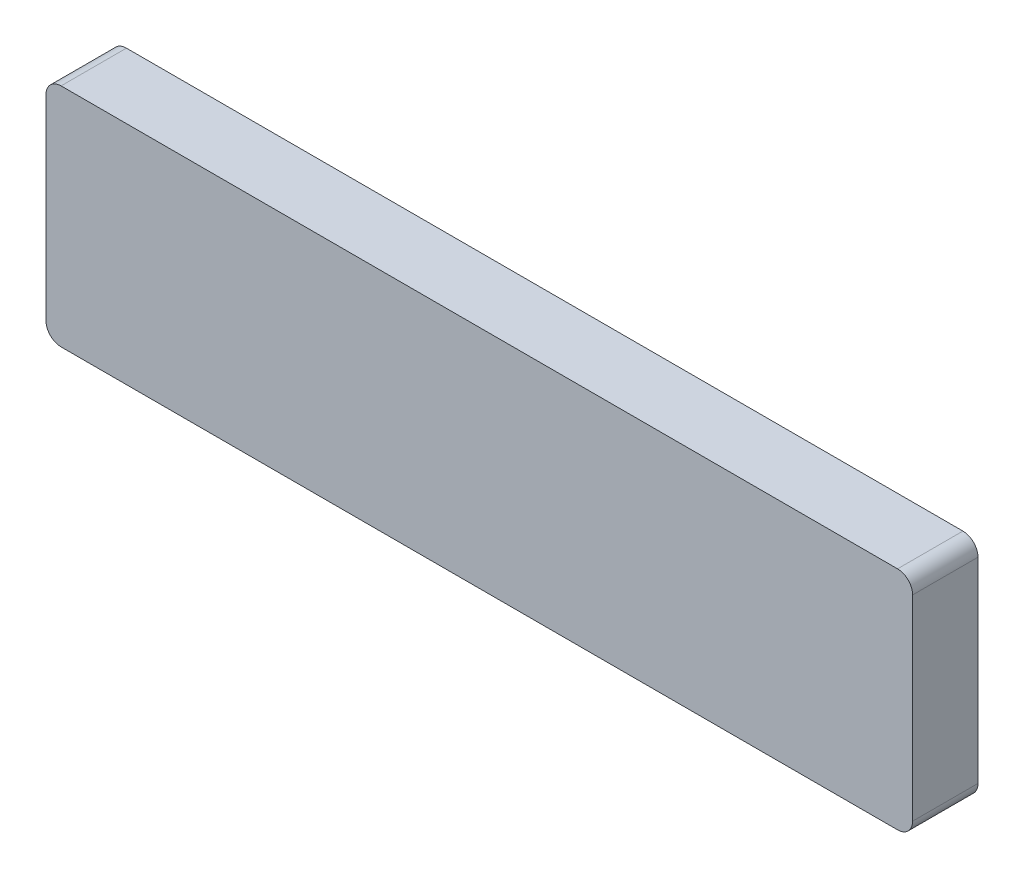
ISO-10303-21;
HEADER;
FILE_DESCRIPTION(('STEP AP214'),'2;1');
FILE_NAME('part.step','',(''),(''),'','','');
FILE_SCHEMA(('AUTOMOTIVE_DESIGN { 1 0 10303 214 1 1 1 1 }'));
ENDSEC;
DATA;
#1=APPLICATION_CONTEXT('core data for automotive mechanical design processes');
#2=APPLICATION_PROTOCOL_DEFINITION('international standard','automotive_design',2000,#1);
#3=PRODUCT_CONTEXT('',#1,'mechanical');
#4=PRODUCT('Part','Part','',(#3));
#5=PRODUCT_RELATED_PRODUCT_CATEGORY('part','',(#4));
#6=PRODUCT_DEFINITION_FORMATION('','',#4);
#7=PRODUCT_DEFINITION_CONTEXT('part definition',#1,'design');
#8=PRODUCT_DEFINITION('design','',#6,#7);
#9=PRODUCT_DEFINITION_SHAPE('','',#8);
#10=(LENGTH_UNIT() NAMED_UNIT(*) SI_UNIT(.MILLI.,.METRE.));
#11=(NAMED_UNIT(*) PLANE_ANGLE_UNIT() SI_UNIT($,.RADIAN.));
#12=(NAMED_UNIT(*) SI_UNIT($,.STERADIAN.) SOLID_ANGLE_UNIT());
#13=UNCERTAINTY_MEASURE_WITH_UNIT(LENGTH_MEASURE(1.E-05),#10,'distance_accuracy_value','');
#14=(GEOMETRIC_REPRESENTATION_CONTEXT(3) GLOBAL_UNCERTAINTY_ASSIGNED_CONTEXT((#13)) GLOBAL_UNIT_ASSIGNED_CONTEXT((#10,
#11,#12)) REPRESENTATION_CONTEXT('',''));
#15=CARTESIAN_POINT('',(0.,0.,0.));
#16=DIRECTION('',(0.,0.,1.));
#17=DIRECTION('',(1.,0.,0.));
#18=AXIS2_PLACEMENT_3D('',#15,#16,#17);
#19=CARTESIAN_POINT('',(-57.5,-15.01,-3.17500000000001));
#20=DIRECTION('',(0.,0.,1.));
#21=DIRECTION('',(1.,0.,0.));
#22=AXIS2_PLACEMENT_3D('',#19,#20,#21);
#23=PLANE('',#22);
#24=CARTESIAN_POINT('',(55.5,13.,-3.17500000000001));
#25=DIRECTION('',(0.,0.,1.));
#26=DIRECTION('',(1.,0.,0.));
#27=AXIS2_PLACEMENT_3D('',#24,#25,#26);
#28=CIRCLE('',#27,2.);
#29=CARTESIAN_POINT('',(55.5,15.,-3.17500000000001));
#30=VERTEX_POINT('',#29);
#31=CARTESIAN_POINT('',(57.5,13.,-3.17500000000001));
#32=VERTEX_POINT('',#31);
#33=EDGE_CURVE('E38',#30,#32,#28,.F.);
#34=ORIENTED_EDGE('',*,*,#33,.T.);
#35=DIRECTION('',(0.,1.,0.));
#36=VECTOR('',#35,1.);
#37=CARTESIAN_POINT('',(57.5,0.,-3.17500000000001));
#38=LINE('',#37,#36);
#39=CARTESIAN_POINT('',(57.5,-13.,-3.17500000000001));
#40=VERTEX_POINT('',#39);
#41=EDGE_CURVE('E291',#40,#32,#38,.T.);
#42=ORIENTED_EDGE('',*,*,#41,.F.);
#43=CARTESIAN_POINT('',(55.5,-13.,-3.17500000000001));
#44=DIRECTION('',(0.,0.,1.));
#45=DIRECTION('',(1.,0.,0.));
#46=AXIS2_PLACEMENT_3D('',#43,#44,#45);
#47=CIRCLE('',#46,2.);
#48=CARTESIAN_POINT('',(55.5,-15.,-3.17500000000001));
#49=VERTEX_POINT('',#48);
#50=EDGE_CURVE('E318',#40,#49,#47,.F.);
#51=ORIENTED_EDGE('',*,*,#50,.T.);
#52=DIRECTION('',(-1.,0.,0.));
#53=VECTOR('',#52,1.);
#54=CARTESIAN_POINT('',(0.,-15.,-3.17500000000001));
#55=LINE('',#54,#53);
#56=CARTESIAN_POINT('',(-55.5,-15.,-3.17500000000001));
#57=VERTEX_POINT('',#56);
#58=EDGE_CURVE('E295',#49,#57,#55,.T.);
#59=ORIENTED_EDGE('',*,*,#58,.T.);
#60=CARTESIAN_POINT('',(-55.5,-13.,-3.17500000000001));
#61=DIRECTION('',(0.,0.,1.));
#62=DIRECTION('',(1.,0.,0.));
#63=AXIS2_PLACEMENT_3D('',#60,#61,#62);
#64=CIRCLE('',#63,2.);
#65=CARTESIAN_POINT('',(-57.5,-13.,-3.17500000000001));
#66=VERTEX_POINT('',#65);
#67=EDGE_CURVE('E43',#57,#66,#64,.F.);
#68=ORIENTED_EDGE('',*,*,#67,.T.);
#69=DIRECTION('',(0.,1.,0.));
#70=VECTOR('',#69,1.);
#71=CARTESIAN_POINT('',(-57.5,0.,-3.17500000000001));
#72=LINE('',#71,#70);
#73=CARTESIAN_POINT('',(-57.5,-10.988,-3.17500000000001));
#74=VERTEX_POINT('',#73);
#75=EDGE_CURVE('E297',#66,#74,#72,.T.);
#76=ORIENTED_EDGE('',*,*,#75,.T.);
#77=DIRECTION('',(-1.,0.,0.));
#78=VECTOR('',#77,1.);
#79=CARTESIAN_POINT('',(-55.3,-10.988,-3.17500000000001));
#80=LINE('',#79,#78);
#81=CARTESIAN_POINT('',(-55.5,-10.988,-3.17500000000001));
#82=VERTEX_POINT('',#81);
#83=EDGE_CURVE('E299',#82,#74,#80,.T.);
#84=ORIENTED_EDGE('',*,*,#83,.F.);
#85=DIRECTION('',(0.,1.,0.));
#86=VECTOR('',#85,1.);
#87=CARTESIAN_POINT('',(-55.5,0.,-3.17500000000001));
#88=LINE('',#87,#86);
#89=CARTESIAN_POINT('',(-55.5,-13.,-3.17500000000001));
#90=VERTEX_POINT('',#89);
#91=EDGE_CURVE('E300',#90,#82,#88,.T.);
#92=ORIENTED_EDGE('',*,*,#91,.F.);
#93=DIRECTION('',(-1.,0.,0.));
#94=VECTOR('',#93,1.);
#95=CARTESIAN_POINT('',(0.,-13.,-3.17500000000001));
#96=LINE('',#95,#94);
#97=CARTESIAN_POINT('',(55.5,-13.,-3.17500000000001));
#98=VERTEX_POINT('',#97);
#99=EDGE_CURVE('E307',#98,#90,#96,.T.);
#100=ORIENTED_EDGE('',*,*,#99,.F.);
#101=DIRECTION('',(0.,1.,0.));
#102=VECTOR('',#101,1.);
#103=CARTESIAN_POINT('',(55.5,0.,-3.17500000000001));
#104=LINE('',#103,#102);
#105=CARTESIAN_POINT('',(55.5,13.,-3.17500000000001));
#106=VERTEX_POINT('',#105);
#107=EDGE_CURVE('E310',#98,#106,#104,.T.);
#108=ORIENTED_EDGE('',*,*,#107,.T.);
#109=DIRECTION('',(-1.,0.,0.));
#110=VECTOR('',#109,1.);
#111=CARTESIAN_POINT('',(0.,13.,-3.17500000000001));
#112=LINE('',#111,#110);
#113=CARTESIAN_POINT('',(-55.5,13.,-3.17500000000001));
#114=VERTEX_POINT('',#113);
#115=EDGE_CURVE('E302',#106,#114,#112,.T.);
#116=ORIENTED_EDGE('',*,*,#115,.T.);
#117=CARTESIAN_POINT('',(-55.5,4.73600000000001,-3.17500000000001));
#118=VERTEX_POINT('',#117);
#119=EDGE_CURVE('E304',#118,#114,#88,.T.);
#120=ORIENTED_EDGE('',*,*,#119,.F.);
#121=DIRECTION('',(-1.,0.,0.));
#122=VECTOR('',#121,1.);
#123=CARTESIAN_POINT('',(-55.3,4.73600000000001,-3.17500000000001));
#124=LINE('',#123,#122);
#125=CARTESIAN_POINT('',(-57.5,4.73600000000001,-3.17500000000001));
#126=VERTEX_POINT('',#125);
#127=EDGE_CURVE('E289',#126,#118,#124,.F.);
#128=ORIENTED_EDGE('',*,*,#127,.F.);
#129=CARTESIAN_POINT('',(-57.5,13.,-3.17500000000001));
#130=VERTEX_POINT('',#129);
#131=EDGE_CURVE('E293',#126,#130,#72,.T.);
#132=ORIENTED_EDGE('',*,*,#131,.T.);
#133=CARTESIAN_POINT('',(-55.5,13.,-3.17500000000001));
#134=DIRECTION('',(0.,0.,1.));
#135=DIRECTION('',(1.,0.,0.));
#136=AXIS2_PLACEMENT_3D('',#133,#134,#135);
#137=CIRCLE('',#136,2.);
#138=CARTESIAN_POINT('',(-55.5,15.,-3.17500000000001));
#139=VERTEX_POINT('',#138);
#140=EDGE_CURVE('E11',#130,#139,#137,.F.);
#141=ORIENTED_EDGE('',*,*,#140,.T.);
#142=DIRECTION('',(-1.,0.,0.));
#143=VECTOR('',#142,1.);
#144=CARTESIAN_POINT('',(0.,15.,-3.17500000000001));
#145=LINE('',#144,#143);
#146=EDGE_CURVE('E57',#30,#139,#145,.T.);
#147=ORIENTED_EDGE('',*,*,#146,.F.);
#148=EDGE_LOOP('',(#34,#42,#51,#59,#68,#76,#84,#92,#100,#108,#116,#120,#128,#132,#141,#147));
#149=FACE_BOUND('',#148,.T.);
#150=ADVANCED_FACE('F35',(#149),#23,.F.);
#151=CARTESIAN_POINT('',(-57.5,-4.138,-3.17500000000001));
#152=VERTEX_POINT('',#151);
#153=CARTESIAN_POINT('',(-57.5,-2.114,-3.17500000000001));
#154=VERTEX_POINT('',#153);
#155=EDGE_CURVE('E296',#152,#154,#72,.T.);
#156=ORIENTED_EDGE('',*,*,#155,.T.);
#157=DIRECTION('',(-1.,0.,0.));
#158=VECTOR('',#157,1.);
#159=CARTESIAN_POINT('',(-55.3,-2.114,-3.17500000000001));
#160=LINE('',#159,#158);
#161=CARTESIAN_POINT('',(-55.5,-2.114,-3.17500000000001));
#162=VERTEX_POINT('',#161);
#163=EDGE_CURVE('E269',#162,#154,#160,.T.);
#164=ORIENTED_EDGE('',*,*,#163,.F.);
#165=CARTESIAN_POINT('',(-55.5,-4.138,-3.17500000000001));
#166=VERTEX_POINT('',#165);
#167=EDGE_CURVE('E303',#166,#162,#88,.T.);
#168=ORIENTED_EDGE('',*,*,#167,.F.);
#169=DIRECTION('',(-1.,0.,0.));
#170=VECTOR('',#169,1.);
#171=CARTESIAN_POINT('',(-55.3,-4.138,-3.17500000000001));
#172=LINE('',#171,#170);
#173=EDGE_CURVE('E305',#152,#166,#172,.F.);
#174=ORIENTED_EDGE('',*,*,#173,.F.);
#175=EDGE_LOOP('',(#156,#164,#168,#174));
#176=FACE_BOUND('',#175,.T.);
#177=ADVANCED_FACE('F355',(#176),#23,.F.);
#178=CARTESIAN_POINT('',(-55.3,0.,0.249999999999999));
#179=DIRECTION('',(0.,0.,1.));
#180=DIRECTION('',(1.,0.,0.));
#181=AXIS2_PLACEMENT_3D('',#178,#179,#180);
#182=PLANE('',#181);
#183=DIRECTION('',(-1.,0.,0.));
#184=VECTOR('',#183,1.);
#185=CARTESIAN_POINT('',(-55.3,6.805,0.249999999999999));
#186=LINE('',#185,#184);
#187=CARTESIAN_POINT('',(-55.5,6.805,0.249999999999999));
#188=VERTEX_POINT('',#187);
#189=CARTESIAN_POINT('',(-57.5,6.805,0.25));
#190=VERTEX_POINT('',#189);
#191=EDGE_CURVE('E184',#188,#190,#186,.T.);
#192=ORIENTED_EDGE('',*,*,#191,.T.);
#193=DIRECTION('',(0.,1.,0.));
#194=VECTOR('',#193,1.);
#195=CARTESIAN_POINT('',(-57.5,0.,0.249999999999999));
#196=LINE('',#195,#194);
#197=CARTESIAN_POINT('',(-57.5,11.75,0.249999999999999));
#198=VERTEX_POINT('',#197);
#199=EDGE_CURVE('E188',#190,#198,#196,.T.);
#200=ORIENTED_EDGE('',*,*,#199,.T.);
#201=DIRECTION('',(-1.,0.,0.));
#202=VECTOR('',#201,1.);
#203=CARTESIAN_POINT('',(-55.3,11.75,0.249999999999999));
#204=LINE('',#203,#202);
#205=CARTESIAN_POINT('',(-55.5,11.75,0.25));
#206=VERTEX_POINT('',#205);
#207=EDGE_CURVE('E172',#206,#198,#204,.T.);
#208=ORIENTED_EDGE('',*,*,#207,.F.);
#209=DIRECTION('',(0.,1.,0.));
#210=VECTOR('',#209,1.);
#211=CARTESIAN_POINT('',(-55.5,0.,0.25));
#212=LINE('',#211,#210);
#213=EDGE_CURVE('E204',#188,#206,#212,.T.);
#214=ORIENTED_EDGE('',*,*,#213,.F.);
#215=EDGE_LOOP('',(#192,#200,#208,#214));
#216=FACE_BOUND('',#215,.T.);
#217=ADVANCED_FACE('F189',(#216),#182,.F.);
#218=CARTESIAN_POINT('',(-55.3,11.75,0.));
#219=DIRECTION('',(0.,-1.,0.));
#220=DIRECTION('',(0.,0.,-1.));
#221=AXIS2_PLACEMENT_3D('',#218,#219,#220);
#222=PLANE('',#221);
#223=DIRECTION('',(0.,0.,1.));
#224=VECTOR('',#223,1.);
#225=CARTESIAN_POINT('',(-55.5,11.75,-129.198643240047));
#226=LINE('',#225,#224);
#227=CARTESIAN_POINT('',(-55.5,11.75,-2.282));
#228=VERTEX_POINT('',#227);
#229=EDGE_CURVE('E180',#228,#206,#226,.T.);
#230=ORIENTED_EDGE('',*,*,#229,.T.);
#231=ORIENTED_EDGE('',*,*,#207,.T.);
#232=DIRECTION('',(0.,0.,1.));
#233=VECTOR('',#232,1.);
#234=CARTESIAN_POINT('',(-57.5,11.75,0.));
#235=LINE('',#234,#233);
#236=CARTESIAN_POINT('',(-57.5,11.75,-2.282));
#237=VERTEX_POINT('',#236);
#238=EDGE_CURVE('E177',#237,#198,#235,.T.);
#239=ORIENTED_EDGE('',*,*,#238,.F.);
#240=DIRECTION('',(-1.,0.,0.));
#241=VECTOR('',#240,1.);
#242=CARTESIAN_POINT('',(-55.3,11.75,-2.282));
#243=LINE('',#242,#241);
#244=EDGE_CURVE('E183',#228,#237,#243,.T.);
#245=ORIENTED_EDGE('',*,*,#244,.F.);
#246=EDGE_LOOP('',(#230,#231,#239,#245));
#247=FACE_BOUND('',#246,.T.);
#248=ADVANCED_FACE('F174',(#247),#222,.T.);
#249=CARTESIAN_POINT('',(-55.3,0.,-2.282));
#250=DIRECTION('',(0.,0.,1.));
#251=DIRECTION('',(1.,0.,0.));
#252=AXIS2_PLACEMENT_3D('',#249,#250,#251);
#253=PLANE('',#252);
#254=DIRECTION('',(0.,1.,0.));
#255=VECTOR('',#254,1.);
#256=CARTESIAN_POINT('',(-55.5,0.,-2.28200000000001));
#257=LINE('',#256,#255);
#258=CARTESIAN_POINT('',(-55.5,6.805,-2.282));
#259=VERTEX_POINT('',#258);
#260=EDGE_CURVE('E209',#259,#228,#257,.T.);
#261=ORIENTED_EDGE('',*,*,#260,.T.);
#262=ORIENTED_EDGE('',*,*,#244,.T.);
#263=DIRECTION('',(0.,1.,0.));
#264=VECTOR('',#263,1.);
#265=CARTESIAN_POINT('',(-57.5,0.,-2.282));
#266=LINE('',#265,#264);
#267=CARTESIAN_POINT('',(-57.5,6.805,-2.282));
#268=VERTEX_POINT('',#267);
#269=EDGE_CURVE('E197',#268,#237,#266,.T.);
#270=ORIENTED_EDGE('',*,*,#269,.F.);
#271=DIRECTION('',(-1.,0.,0.));
#272=VECTOR('',#271,1.);
#273=CARTESIAN_POINT('',(-55.3,6.805,-2.282));
#274=LINE('',#273,#272);
#275=EDGE_CURVE('E202',#259,#268,#274,.T.);
#276=ORIENTED_EDGE('',*,*,#275,.F.);
#277=EDGE_LOOP('',(#261,#262,#270,#276));
#278=FACE_BOUND('',#277,.T.);
#279=ADVANCED_FACE('F434',(#278),#253,.T.);
#280=CARTESIAN_POINT('',(-55.3,6.805,0.));
#281=DIRECTION('',(0.,-1.,0.));
#282=DIRECTION('',(0.,0.,-1.));
#283=AXIS2_PLACEMENT_3D('',#280,#281,#282);
#284=PLANE('',#283);
#285=ORIENTED_EDGE('',*,*,#275,.T.);
#286=DIRECTION('',(0.,0.,1.));
#287=VECTOR('',#286,1.);
#288=CARTESIAN_POINT('',(-57.5,6.805,0.));
#289=LINE('',#288,#287);
#290=EDGE_CURVE('E193',#268,#190,#289,.T.);
#291=ORIENTED_EDGE('',*,*,#290,.T.);
#292=ORIENTED_EDGE('',*,*,#191,.F.);
#293=DIRECTION('',(0.,0.,1.));
#294=VECTOR('',#293,1.);
#295=CARTESIAN_POINT('',(-55.5,6.805,-129.198643240047));
#296=LINE('',#295,#294);
#297=EDGE_CURVE('E211',#259,#188,#296,.T.);
#298=ORIENTED_EDGE('',*,*,#297,.F.);
#299=EDGE_LOOP('',(#285,#291,#292,#298));
#300=FACE_BOUND('',#299,.T.);
#301=ADVANCED_FACE('F430',(#300),#284,.F.);
#302=CARTESIAN_POINT('',(-55.3,-7.563,-3.175));
#303=DIRECTION('',(-1.,0.,0.));
#304=DIRECTION('',(0.,0.,1.));
#305=AXIS2_PLACEMENT_3D('',#302,#303,#304);
#306=CYLINDRICAL_SURFACE('',#305,3.425);
#307=CARTESIAN_POINT('',(-57.5,-7.563,-3.175));
#308=DIRECTION('',(-1.,0.,0.));
#309=DIRECTION('',(0.,0.,1.));
#310=AXIS2_PLACEMENT_3D('',#307,#308,#309);
#311=CIRCLE('',#310,3.425);
#312=EDGE_CURVE('E220',#74,#152,#311,.T.);
#313=ORIENTED_EDGE('',*,*,#312,.T.);
#314=ORIENTED_EDGE('',*,*,#173,.T.);
#315=CARTESIAN_POINT('',(-55.5,-7.563,-3.175));
#316=DIRECTION('',(-1.,0.,0.));
#317=DIRECTION('',(0.,0.,1.));
#318=AXIS2_PLACEMENT_3D('',#315,#316,#317);
#319=CIRCLE('',#318,3.425);
#320=EDGE_CURVE('E223',#82,#166,#319,.T.);
#321=ORIENTED_EDGE('',*,*,#320,.F.);
#322=ORIENTED_EDGE('',*,*,#83,.T.);
#323=EDGE_LOOP('',(#313,#314,#321,#322));
#324=FACE_BOUND('',#323,.T.);
#325=ADVANCED_FACE('F368',(#324),#306,.F.);
#326=CARTESIAN_POINT('',(57.5,0.,-129.198643240047));
#327=DIRECTION('',(-1.,0.,0.));
#328=DIRECTION('',(0.,0.,1.));
#329=AXIS2_PLACEMENT_3D('',#326,#327,#328);
#330=PLANE('',#329);
#331=DIRECTION('',(0.,0.,1.));
#332=VECTOR('',#331,1.);
#333=CARTESIAN_POINT('',(57.5,-13.,-8.35));
#334=LINE('',#333,#332);
#335=CARTESIAN_POINT('',(57.5,-13.,5.50000000000001));
#336=VERTEX_POINT('',#335);
#337=EDGE_CURVE('E253',#336,#40,#334,.F.);
#338=ORIENTED_EDGE('',*,*,#337,.T.);
#339=ORIENTED_EDGE('',*,*,#41,.T.);
#340=DIRECTION('',(0.,0.,1.));
#341=VECTOR('',#340,1.);
#342=CARTESIAN_POINT('',(57.5,13.,-129.198643240047));
#343=LINE('',#342,#341);
#344=CARTESIAN_POINT('',(57.5,13.,5.50000000000001));
#345=VERTEX_POINT('',#344);
#346=EDGE_CURVE('E251',#32,#345,#343,.T.);
#347=ORIENTED_EDGE('',*,*,#346,.T.);
#348=DIRECTION('',(0.,-1.,0.));
#349=VECTOR('',#348,1.);
#350=CARTESIAN_POINT('',(57.5,0.,5.50000000000001));
#351=LINE('',#350,#349);
#352=EDGE_CURVE('E226',#345,#336,#351,.T.);
#353=ORIENTED_EDGE('',*,*,#352,.T.);
#354=EDGE_LOOP('',(#338,#339,#347,#353));
#355=FACE_BOUND('',#354,.T.);
#356=ADVANCED_FACE('F332',(#355),#330,.F.);
#357=CARTESIAN_POINT('',(0.,15.,-129.198643240047));
#358=DIRECTION('',(0.,-1.,0.));
#359=DIRECTION('',(0.,0.,-1.));
#360=AXIS2_PLACEMENT_3D('',#357,#358,#359);
#361=PLANE('',#360);
#362=DIRECTION('',(0.,0.,1.));
#363=VECTOR('',#362,1.);
#364=CARTESIAN_POINT('',(55.5,15.,-129.198643240047));
#365=LINE('',#364,#363);
#366=CARTESIAN_POINT('',(55.5,15.,5.50000000000001));
#367=VERTEX_POINT('',#366);
#368=EDGE_CURVE('E258',#367,#30,#365,.F.);
#369=ORIENTED_EDGE('',*,*,#368,.T.);
#370=ORIENTED_EDGE('',*,*,#146,.T.);
#371=DIRECTION('',(0.,0.,1.));
#372=VECTOR('',#371,1.);
#373=CARTESIAN_POINT('',(-55.5,15.,5.50000000000001));
#374=LINE('',#373,#372);
#375=CARTESIAN_POINT('',(-55.5,15.,5.50000000000001));
#376=VERTEX_POINT('',#375);
#377=EDGE_CURVE('E256',#139,#376,#374,.T.);
#378=ORIENTED_EDGE('',*,*,#377,.T.);
#379=DIRECTION('',(1.,0.,0.));
#380=VECTOR('',#379,1.);
#381=CARTESIAN_POINT('',(0.,15.,5.50000000000001));
#382=LINE('',#381,#380);
#383=EDGE_CURVE('E231',#376,#367,#382,.T.);
#384=ORIENTED_EDGE('',*,*,#383,.T.);
#385=EDGE_LOOP('',(#369,#370,#378,#384));
#386=FACE_BOUND('',#385,.T.);
#387=ADVANCED_FACE('F418',(#386),#361,.F.);
#388=CARTESIAN_POINT('',(0.,0.,5.5));
#389=DIRECTION('',(0.,0.,1.));
#390=DIRECTION('',(1.,0.,0.));
#391=AXIS2_PLACEMENT_3D('',#388,#389,#390);
#392=PLANE('',#391);
#393=DIRECTION('',(1.,0.,0.));
#394=VECTOR('',#393,1.);
#395=CARTESIAN_POINT('',(0.,-15.,5.50000000000001));
#396=LINE('',#395,#394);
#397=CARTESIAN_POINT('',(-55.5,-15.,5.50000000000001));
#398=VERTEX_POINT('',#397);
#399=CARTESIAN_POINT('',(55.5,-15.,5.50000000000001));
#400=VERTEX_POINT('',#399);
#401=EDGE_CURVE('E230',#398,#400,#396,.T.);
#402=ORIENTED_EDGE('',*,*,#401,.T.);
#403=CARTESIAN_POINT('',(55.5,-13.,5.50000000000001));
#404=DIRECTION('',(0.,0.,1.));
#405=DIRECTION('',(1.,0.,0.));
#406=AXIS2_PLACEMENT_3D('',#403,#404,#405);
#407=CIRCLE('',#406,2.);
#408=EDGE_CURVE('E249',#400,#336,#407,.T.);
#409=ORIENTED_EDGE('',*,*,#408,.T.);
#410=ORIENTED_EDGE('',*,*,#352,.F.);
#411=CARTESIAN_POINT('',(55.5,13.,5.50000000000001));
#412=DIRECTION('',(0.,0.,1.));
#413=DIRECTION('',(1.,0.,0.));
#414=AXIS2_PLACEMENT_3D('',#411,#412,#413);
#415=CIRCLE('',#414,2.);
#416=EDGE_CURVE('E247',#345,#367,#415,.T.);
#417=ORIENTED_EDGE('',*,*,#416,.T.);
#418=ORIENTED_EDGE('',*,*,#383,.F.);
#419=CARTESIAN_POINT('',(-55.5,13.,5.50000000000001));
#420=DIRECTION('',(0.,0.,1.));
#421=DIRECTION('',(1.,0.,0.));
#422=AXIS2_PLACEMENT_3D('',#419,#420,#421);
#423=CIRCLE('',#422,2.);
#424=CARTESIAN_POINT('',(-57.5,13.,5.50000000000001));
#425=VERTEX_POINT('',#424);
#426=EDGE_CURVE('E243',#376,#425,#423,.T.);
#427=ORIENTED_EDGE('',*,*,#426,.T.);
#428=DIRECTION('',(0.,-1.,0.));
#429=VECTOR('',#428,1.);
#430=CARTESIAN_POINT('',(-57.5,0.,5.50000000000001));
#431=LINE('',#430,#429);
#432=CARTESIAN_POINT('',(-57.5,-13.,5.50000000000001));
#433=VERTEX_POINT('',#432);
#434=EDGE_CURVE('E227',#425,#433,#431,.T.);
#435=ORIENTED_EDGE('',*,*,#434,.T.);
#436=CARTESIAN_POINT('',(-55.5,-13.,5.50000000000001));
#437=DIRECTION('',(0.,0.,1.));
#438=DIRECTION('',(1.,0.,0.));
#439=AXIS2_PLACEMENT_3D('',#436,#437,#438);
#440=CIRCLE('',#439,2.);
#441=EDGE_CURVE('E245',#433,#398,#440,.T.);
#442=ORIENTED_EDGE('',*,*,#441,.T.);
#443=EDGE_LOOP('',(#402,#409,#410,#417,#418,#427,#435,#442));
#444=FACE_BOUND('',#443,.T.);
#445=ADVANCED_FACE('F404',(#444),#392,.T.);
#446=CARTESIAN_POINT('',(-55.5,0.,-129.198643240047));
#447=DIRECTION('',(-1.,0.,0.));
#448=DIRECTION('',(0.,0.,1.));
#449=AXIS2_PLACEMENT_3D('',#446,#447,#448);
#450=PLANE('',#449);
#451=ORIENTED_EDGE('',*,*,#260,.F.);
#452=ORIENTED_EDGE('',*,*,#297,.T.);
#453=ORIENTED_EDGE('',*,*,#213,.T.);
#454=ORIENTED_EDGE('',*,*,#229,.F.);
#455=EDGE_LOOP('',(#451,#452,#453,#454));
#456=FACE_BOUND('',#455,.T.);
#457=DIRECTION('',(0.,0.,-1.));
#458=VECTOR('',#457,1.);
#459=CARTESIAN_POINT('',(-55.5,-13.,-129.198643240047));
#460=LINE('',#459,#458);
#461=CARTESIAN_POINT('',(-55.5,-13.,3.5));
#462=VERTEX_POINT('',#461);
#463=EDGE_CURVE('E278',#462,#90,#460,.T.);
#464=ORIENTED_EDGE('',*,*,#463,.T.);
#465=ORIENTED_EDGE('',*,*,#91,.T.);
#466=ORIENTED_EDGE('',*,*,#320,.T.);
#467=ORIENTED_EDGE('',*,*,#167,.T.);
#468=CARTESIAN_POINT('',(-55.5,1.311,-3.17500000000001));
#469=DIRECTION('',(-1.,0.,0.));
#470=DIRECTION('',(0.,0.,1.));
#471=AXIS2_PLACEMENT_3D('',#468,#469,#470);
#472=CIRCLE('',#471,3.425);
#473=EDGE_CURVE('E217',#162,#118,#472,.T.);
#474=ORIENTED_EDGE('',*,*,#473,.T.);
#475=ORIENTED_EDGE('',*,*,#119,.T.);
#476=DIRECTION('',(0.,0.,-1.));
#477=VECTOR('',#476,1.);
#478=CARTESIAN_POINT('',(-55.5,13.,-129.198643240047));
#479=LINE('',#478,#477);
#480=CARTESIAN_POINT('',(-55.5,13.,3.5));
#481=VERTEX_POINT('',#480);
#482=EDGE_CURVE('E281',#481,#114,#479,.T.);
#483=ORIENTED_EDGE('',*,*,#482,.F.);
#484=DIRECTION('',(0.,-1.,0.));
#485=VECTOR('',#484,1.);
#486=CARTESIAN_POINT('',(-55.5,0.,3.5));
#487=LINE('',#486,#485);
#488=EDGE_CURVE('E266',#481,#462,#487,.T.);
#489=ORIENTED_EDGE('',*,*,#488,.T.);
#490=EDGE_LOOP('',(#464,#465,#466,#467,#474,#475,#483,#489));
#491=FACE_BOUND('',#490,.T.);
#492=ADVANCED_FACE('F363',(#456,#491),#450,.F.);
#493=CARTESIAN_POINT('',(-57.5,0.,-129.198643240047));
#494=DIRECTION('',(-1.,0.,0.));
#495=DIRECTION('',(0.,0.,1.));
#496=AXIS2_PLACEMENT_3D('',#493,#494,#495);
#497=PLANE('',#496);
#498=ORIENTED_EDGE('',*,*,#75,.F.);
#499=DIRECTION('',(0.,0.,1.));
#500=VECTOR('',#499,1.);
#501=CARTESIAN_POINT('',(-57.5,-13.,-129.198643240047));
#502=LINE('',#501,#500);
#503=EDGE_CURVE('E263',#66,#433,#502,.T.);
#504=ORIENTED_EDGE('',*,*,#503,.T.);
#505=ORIENTED_EDGE('',*,*,#434,.F.);
#506=DIRECTION('',(0.,0.,1.));
#507=VECTOR('',#506,1.);
#508=CARTESIAN_POINT('',(-57.5,13.,-8.35));
#509=LINE('',#508,#507);
#510=EDGE_CURVE('E260',#425,#130,#509,.F.);
#511=ORIENTED_EDGE('',*,*,#510,.T.);
#512=ORIENTED_EDGE('',*,*,#131,.F.);
#513=CARTESIAN_POINT('',(-57.5,1.311,-3.17500000000001));
#514=DIRECTION('',(-1.,0.,0.));
#515=DIRECTION('',(0.,0.,1.));
#516=AXIS2_PLACEMENT_3D('',#513,#514,#515);
#517=CIRCLE('',#516,3.425);
#518=EDGE_CURVE('E214',#154,#126,#517,.T.);
#519=ORIENTED_EDGE('',*,*,#518,.F.);
#520=ORIENTED_EDGE('',*,*,#155,.F.);
#521=ORIENTED_EDGE('',*,*,#312,.F.);
#522=EDGE_LOOP('',(#498,#504,#505,#511,#512,#519,#520,#521));
#523=FACE_BOUND('',#522,.T.);
#524=ORIENTED_EDGE('',*,*,#290,.F.);
#525=ORIENTED_EDGE('',*,*,#269,.T.);
#526=ORIENTED_EDGE('',*,*,#238,.T.);
#527=ORIENTED_EDGE('',*,*,#199,.F.);
#528=EDGE_LOOP('',(#524,#525,#526,#527));
#529=FACE_BOUND('',#528,.T.);
#530=ADVANCED_FACE('F195',(#523,#529),#497,.T.);
#531=CARTESIAN_POINT('',(-55.3,1.311,-3.17500000000001));
#532=DIRECTION('',(-1.,0.,0.));
#533=DIRECTION('',(0.,0.,1.));
#534=AXIS2_PLACEMENT_3D('',#531,#532,#533);
#535=CYLINDRICAL_SURFACE('',#534,3.425);
#536=ORIENTED_EDGE('',*,*,#518,.T.);
#537=ORIENTED_EDGE('',*,*,#127,.T.);
#538=ORIENTED_EDGE('',*,*,#473,.F.);
#539=ORIENTED_EDGE('',*,*,#163,.T.);
#540=EDGE_LOOP('',(#536,#537,#538,#539));
#541=FACE_BOUND('',#540,.T.);
#542=ADVANCED_FACE('F360',(#541),#535,.F.);
#543=CARTESIAN_POINT('',(-55.5,13.,-129.198643240047));
#544=DIRECTION('',(0.,0.,-1.));
#545=DIRECTION('',(-1.,0.,0.));
#546=AXIS2_PLACEMENT_3D('',#543,#544,#545);
#547=CYLINDRICAL_SURFACE('',#546,2.);
#548=ORIENTED_EDGE('',*,*,#140,.F.);
#549=ORIENTED_EDGE('',*,*,#510,.F.);
#550=ORIENTED_EDGE('',*,*,#426,.F.);
#551=ORIENTED_EDGE('',*,*,#377,.F.);
#552=EDGE_LOOP('',(#548,#549,#550,#551));
#553=FACE_BOUND('',#552,.T.);
#554=ADVANCED_FACE('F407',(#553),#547,.T.);
#555=CARTESIAN_POINT('',(0.,-15.,-129.198643240047));
#556=DIRECTION('',(0.,-1.,0.));
#557=DIRECTION('',(0.,0.,-1.));
#558=AXIS2_PLACEMENT_3D('',#555,#556,#557);
#559=PLANE('',#558);
#560=ORIENTED_EDGE('',*,*,#58,.F.);
#561=DIRECTION('',(0.,0.,1.));
#562=VECTOR('',#561,1.);
#563=CARTESIAN_POINT('',(55.5,-15.,5.50000000000001));
#564=LINE('',#563,#562);
#565=EDGE_CURVE('E241',#49,#400,#564,.T.);
#566=ORIENTED_EDGE('',*,*,#565,.T.);
#567=ORIENTED_EDGE('',*,*,#401,.F.);
#568=DIRECTION('',(0.,0.,1.));
#569=VECTOR('',#568,1.);
#570=CARTESIAN_POINT('',(-55.5,-15.,-129.198643240047));
#571=LINE('',#570,#569);
#572=EDGE_CURVE('E238',#398,#57,#571,.F.);
#573=ORIENTED_EDGE('',*,*,#572,.T.);
#574=EDGE_LOOP('',(#560,#566,#567,#573));
#575=FACE_BOUND('',#574,.T.);
#576=ADVANCED_FACE('F339',(#575),#559,.T.);
#577=CARTESIAN_POINT('',(-55.5,-13.,-129.198643240047));
#578=DIRECTION('',(0.,0.,1.));
#579=DIRECTION('',(1.,0.,0.));
#580=AXIS2_PLACEMENT_3D('',#577,#578,#579);
#581=CYLINDRICAL_SURFACE('',#580,2.);
#582=ORIENTED_EDGE('',*,*,#67,.F.);
#583=ORIENTED_EDGE('',*,*,#572,.F.);
#584=ORIENTED_EDGE('',*,*,#441,.F.);
#585=ORIENTED_EDGE('',*,*,#503,.F.);
#586=EDGE_LOOP('',(#582,#583,#584,#585));
#587=FACE_BOUND('',#586,.T.);
#588=ADVANCED_FACE('F347',(#587),#581,.T.);
#589=CARTESIAN_POINT('',(55.5,13.,-129.198643240047));
#590=DIRECTION('',(0.,0.,1.));
#591=DIRECTION('',(1.,0.,0.));
#592=AXIS2_PLACEMENT_3D('',#589,#590,#591);
#593=CYLINDRICAL_SURFACE('',#592,2.);
#594=ORIENTED_EDGE('',*,*,#33,.F.);
#595=ORIENTED_EDGE('',*,*,#368,.F.);
#596=ORIENTED_EDGE('',*,*,#416,.F.);
#597=ORIENTED_EDGE('',*,*,#346,.F.);
#598=EDGE_LOOP('',(#594,#595,#596,#597));
#599=FACE_BOUND('',#598,.T.);
#600=ADVANCED_FACE('F329',(#599),#593,.T.);
#601=CARTESIAN_POINT('',(55.5,-13.,-129.198643240047));
#602=DIRECTION('',(0.,0.,-1.));
#603=DIRECTION('',(-1.,0.,0.));
#604=AXIS2_PLACEMENT_3D('',#601,#602,#603);
#605=CYLINDRICAL_SURFACE('',#604,2.);
#606=ORIENTED_EDGE('',*,*,#50,.F.);
#607=ORIENTED_EDGE('',*,*,#337,.F.);
#608=ORIENTED_EDGE('',*,*,#408,.F.);
#609=ORIENTED_EDGE('',*,*,#565,.F.);
#610=EDGE_LOOP('',(#606,#607,#608,#609));
#611=FACE_BOUND('',#610,.T.);
#612=ADVANCED_FACE('F336',(#611),#605,.T.);
#613=CARTESIAN_POINT('',(0.,13.,-129.198643240047));
#614=DIRECTION('',(0.,-1.,0.));
#615=DIRECTION('',(0.,0.,-1.));
#616=AXIS2_PLACEMENT_3D('',#613,#614,#615);
#617=PLANE('',#616);
#618=ORIENTED_EDGE('',*,*,#115,.F.);
#619=DIRECTION('',(0.,0.,-1.));
#620=VECTOR('',#619,1.);
#621=CARTESIAN_POINT('',(55.5,13.,-129.198643240047));
#622=LINE('',#621,#620);
#623=CARTESIAN_POINT('',(55.5,13.,3.5));
#624=VERTEX_POINT('',#623);
#625=EDGE_CURVE('E284',#624,#106,#622,.T.);
#626=ORIENTED_EDGE('',*,*,#625,.F.);
#627=DIRECTION('',(1.,0.,0.));
#628=VECTOR('',#627,1.);
#629=CARTESIAN_POINT('',(0.,13.,3.5));
#630=LINE('',#629,#628);
#631=EDGE_CURVE('E265',#481,#624,#630,.T.);
#632=ORIENTED_EDGE('',*,*,#631,.F.);
#633=ORIENTED_EDGE('',*,*,#482,.T.);
#634=EDGE_LOOP('',(#618,#626,#632,#633));
#635=FACE_BOUND('',#634,.T.);
#636=ADVANCED_FACE('F380',(#635),#617,.T.);
#637=CARTESIAN_POINT('',(0.,0.,3.5));
#638=DIRECTION('',(0.,0.,1.));
#639=DIRECTION('',(1.,0.,0.));
#640=AXIS2_PLACEMENT_3D('',#637,#638,#639);
#641=PLANE('',#640);
#642=DIRECTION('',(1.,0.,0.));
#643=VECTOR('',#642,1.);
#644=CARTESIAN_POINT('',(0.,-13.,3.5));
#645=LINE('',#644,#643);
#646=CARTESIAN_POINT('',(55.5,-13.,3.5));
#647=VERTEX_POINT('',#646);
#648=EDGE_CURVE('E270',#462,#647,#645,.T.);
#649=ORIENTED_EDGE('',*,*,#648,.F.);
#650=ORIENTED_EDGE('',*,*,#488,.F.);
#651=ORIENTED_EDGE('',*,*,#631,.T.);
#652=DIRECTION('',(0.,-1.,0.));
#653=VECTOR('',#652,1.);
#654=CARTESIAN_POINT('',(55.5,0.,3.5));
#655=LINE('',#654,#653);
#656=EDGE_CURVE('E276',#624,#647,#655,.T.);
#657=ORIENTED_EDGE('',*,*,#656,.T.);
#658=EDGE_LOOP('',(#649,#650,#651,#657));
#659=FACE_BOUND('',#658,.T.);
#660=ADVANCED_FACE('F382',(#659),#641,.F.);
#661=CARTESIAN_POINT('',(0.,-13.,-129.198643240047));
#662=DIRECTION('',(0.,-1.,0.));
#663=DIRECTION('',(0.,0.,-1.));
#664=AXIS2_PLACEMENT_3D('',#661,#662,#663);
#665=PLANE('',#664);
#666=DIRECTION('',(0.,0.,-1.));
#667=VECTOR('',#666,1.);
#668=CARTESIAN_POINT('',(55.5,-13.,-129.198643240047));
#669=LINE('',#668,#667);
#670=EDGE_CURVE('E273',#647,#98,#669,.T.);
#671=ORIENTED_EDGE('',*,*,#670,.T.);
#672=ORIENTED_EDGE('',*,*,#99,.T.);
#673=ORIENTED_EDGE('',*,*,#463,.F.);
#674=ORIENTED_EDGE('',*,*,#648,.T.);
#675=EDGE_LOOP('',(#671,#672,#673,#674));
#676=FACE_BOUND('',#675,.T.);
#677=ADVANCED_FACE('F372',(#676),#665,.F.);
#678=CARTESIAN_POINT('',(55.5,0.,-129.198643240047));
#679=DIRECTION('',(-1.,0.,0.));
#680=DIRECTION('',(0.,0.,1.));
#681=AXIS2_PLACEMENT_3D('',#678,#679,#680);
#682=PLANE('',#681);
#683=ORIENTED_EDGE('',*,*,#107,.F.);
#684=ORIENTED_EDGE('',*,*,#670,.F.);
#685=ORIENTED_EDGE('',*,*,#656,.F.);
#686=ORIENTED_EDGE('',*,*,#625,.T.);
#687=EDGE_LOOP('',(#683,#684,#685,#686));
#688=FACE_BOUND('',#687,.T.);
#689=ADVANCED_FACE('F376',(#688),#682,.T.);
#690=CLOSED_SHELL('',(#150,#177,#217,#248,#279,#301,#325,#356,#387,#445,#492,#530,#542,#554,
#576,#588,#600,#612,#636,#660,#677,#689));
#691=MANIFOLD_SOLID_BREP('B2',#690);
#692=ADVANCED_BREP_SHAPE_REPRESENTATION('',(#18,#691),#14);
#693=SHAPE_DEFINITION_REPRESENTATION(#9,#692);
ENDSEC;
END-ISO-10303-21;
